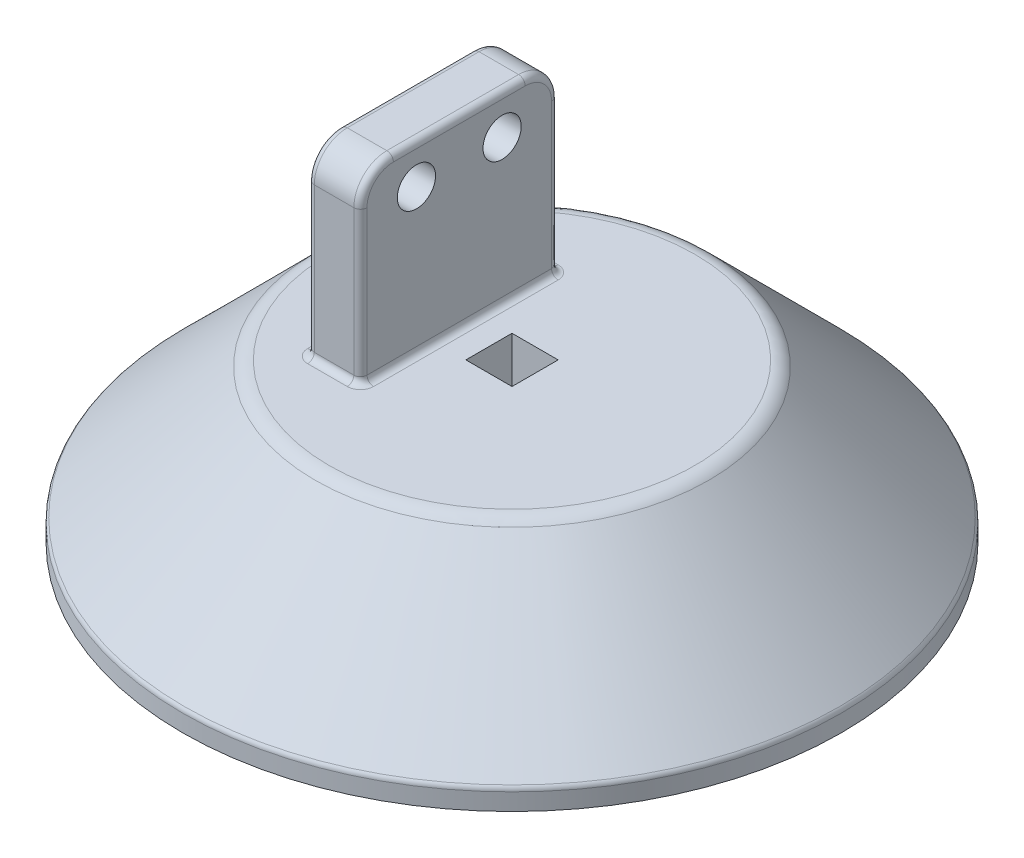
ISO-10303-21;
HEADER;
FILE_DESCRIPTION(('STEP AP214'),'2;1');
FILE_NAME('part.step','',(''),(''),'','','');
FILE_SCHEMA(('AUTOMOTIVE_DESIGN { 1 0 10303 214 1 1 1 1 }'));
ENDSEC;
DATA;
#1=APPLICATION_CONTEXT('core data for automotive mechanical design processes');
#2=APPLICATION_PROTOCOL_DEFINITION('international standard','automotive_design',2000,#1);
#3=PRODUCT_CONTEXT('',#1,'mechanical');
#4=PRODUCT('Part','Part','',(#3));
#5=PRODUCT_RELATED_PRODUCT_CATEGORY('part','',(#4));
#6=PRODUCT_DEFINITION_FORMATION('','',#4);
#7=PRODUCT_DEFINITION_CONTEXT('part definition',#1,'design');
#8=PRODUCT_DEFINITION('design','',#6,#7);
#9=PRODUCT_DEFINITION_SHAPE('','',#8);
#10=(LENGTH_UNIT() NAMED_UNIT(*) SI_UNIT(.MILLI.,.METRE.));
#11=(NAMED_UNIT(*) PLANE_ANGLE_UNIT() SI_UNIT($,.RADIAN.));
#12=(NAMED_UNIT(*) SI_UNIT($,.STERADIAN.) SOLID_ANGLE_UNIT());
#13=UNCERTAINTY_MEASURE_WITH_UNIT(LENGTH_MEASURE(1.E-05),#10,'distance_accuracy_value','');
#14=(GEOMETRIC_REPRESENTATION_CONTEXT(3) GLOBAL_UNCERTAINTY_ASSIGNED_CONTEXT((#13)) GLOBAL_UNIT_ASSIGNED_CONTEXT((#10,
#11,#12)) REPRESENTATION_CONTEXT('',''));
#15=CARTESIAN_POINT('',(0.,0.,0.));
#16=DIRECTION('',(0.,0.,1.));
#17=DIRECTION('',(1.,0.,0.));
#18=AXIS2_PLACEMENT_3D('',#15,#16,#17);
#19=CARTESIAN_POINT('',(0.,24.,0.));
#20=DIRECTION('',(0.,-1.,0.));
#21=DIRECTION('',(0.,0.,-1.));
#22=AXIS2_PLACEMENT_3D('',#19,#20,#21);
#23=PLANE('',#22);
#24=DIRECTION('',(1.,0.,0.));
#25=VECTOR('',#24,1.);
#26=CARTESIAN_POINT('',(-3.5,24.,3.5));
#27=LINE('',#26,#25);
#28=CARTESIAN_POINT('',(-3.5,24.,3.5));
#29=VERTEX_POINT('',#28);
#30=CARTESIAN_POINT('',(3.5,24.,3.5));
#31=VERTEX_POINT('',#30);
#32=EDGE_CURVE('E201',#29,#31,#27,.T.);
#33=ORIENTED_EDGE('',*,*,#32,.F.);
#34=DIRECTION('',(0.,0.,1.));
#35=VECTOR('',#34,1.);
#36=CARTESIAN_POINT('',(-3.5,24.,-3.5));
#37=LINE('',#36,#35);
#38=CARTESIAN_POINT('',(-3.5,24.,-3.5));
#39=VERTEX_POINT('',#38);
#40=EDGE_CURVE('E52',#39,#29,#37,.T.);
#41=ORIENTED_EDGE('',*,*,#40,.F.);
#42=DIRECTION('',(-1.,0.,0.));
#43=VECTOR('',#42,1.);
#44=CARTESIAN_POINT('',(-3.5,24.,-3.5));
#45=LINE('',#44,#43);
#46=CARTESIAN_POINT('',(3.5,24.,-3.5));
#47=VERTEX_POINT('',#46);
#48=EDGE_CURVE('E192',#47,#39,#45,.T.);
#49=ORIENTED_EDGE('',*,*,#48,.F.);
#50=DIRECTION('',(0.,0.,-1.));
#51=VECTOR('',#50,1.);
#52=CARTESIAN_POINT('',(3.5,24.,-3.5));
#53=LINE('',#52,#51);
#54=EDGE_CURVE('E195',#31,#47,#53,.T.);
#55=ORIENTED_EDGE('',*,*,#54,.F.);
#56=EDGE_LOOP('',(#33,#41,#49,#55));
#57=FACE_BOUND('',#56,.T.);
#58=CARTESIAN_POINT('',(-9.00000000000001,24.,-14.));
#59=DIRECTION('',(0.,-1.,0.));
#60=DIRECTION('',(0.,0.,-1.));
#61=AXIS2_PLACEMENT_3D('',#58,#59,#60);
#62=CIRCLE('',#61,2.);
#63=CARTESIAN_POINT('',(-7.,24.,-14.));
#64=VERTEX_POINT('',#63);
#65=CARTESIAN_POINT('',(-9.00000000000001,24.,-16.));
#66=VERTEX_POINT('',#65);
#67=EDGE_CURVE('E313',#64,#66,#62,.F.);
#68=ORIENTED_EDGE('',*,*,#67,.F.);
#69=DIRECTION('',(0.,0.,-1.));
#70=VECTOR('',#69,1.);
#71=CARTESIAN_POINT('',(-7.,24.,15.));
#72=LINE('',#71,#70);
#73=CARTESIAN_POINT('',(-7.,24.,14.));
#74=VERTEX_POINT('',#73);
#75=EDGE_CURVE('E11',#64,#74,#72,.F.);
#76=ORIENTED_EDGE('',*,*,#75,.T.);
#77=CARTESIAN_POINT('',(-9.00000000000001,24.,14.));
#78=DIRECTION('',(0.,-1.,0.));
#79=DIRECTION('',(0.,0.,-1.));
#80=AXIS2_PLACEMENT_3D('',#77,#78,#79);
#81=CIRCLE('',#80,2.);
#82=CARTESIAN_POINT('',(-9.00000000000001,24.,16.));
#83=VERTEX_POINT('',#82);
#84=EDGE_CURVE('E44',#83,#74,#81,.F.);
#85=ORIENTED_EDGE('',*,*,#84,.F.);
#86=DIRECTION('',(1.,0.,0.));
#87=VECTOR('',#86,1.);
#88=CARTESIAN_POINT('',(-16.,24.,16.));
#89=LINE('',#88,#87);
#90=CARTESIAN_POINT('',(-15.,24.,16.));
#91=VERTEX_POINT('',#90);
#92=EDGE_CURVE('E310',#83,#91,#89,.F.);
#93=ORIENTED_EDGE('',*,*,#92,.T.);
#94=CARTESIAN_POINT('',(-15.,24.,14.));
#95=DIRECTION('',(0.,-1.,0.));
#96=DIRECTION('',(0.,0.,-1.));
#97=AXIS2_PLACEMENT_3D('',#94,#95,#96);
#98=CIRCLE('',#97,2.);
#99=CARTESIAN_POINT('',(-17.,24.,14.));
#100=VERTEX_POINT('',#99);
#101=EDGE_CURVE('E308',#100,#91,#98,.F.);
#102=ORIENTED_EDGE('',*,*,#101,.F.);
#103=DIRECTION('',(0.,0.,1.));
#104=VECTOR('',#103,1.);
#105=CARTESIAN_POINT('',(-17.,24.,-15.));
#106=LINE('',#105,#104);
#107=CARTESIAN_POINT('',(-17.,24.,-14.));
#108=VERTEX_POINT('',#107);
#109=EDGE_CURVE('E304',#100,#108,#106,.F.);
#110=ORIENTED_EDGE('',*,*,#109,.T.);
#111=CARTESIAN_POINT('',(-15.,24.,-14.));
#112=DIRECTION('',(0.,-1.,0.));
#113=DIRECTION('',(0.,0.,-1.));
#114=AXIS2_PLACEMENT_3D('',#111,#112,#113);
#115=CIRCLE('',#114,2.);
#116=CARTESIAN_POINT('',(-15.,24.,-16.));
#117=VERTEX_POINT('',#116);
#118=EDGE_CURVE('E301',#117,#108,#115,.F.);
#119=ORIENTED_EDGE('',*,*,#118,.F.);
#120=DIRECTION('',(-1.,0.,0.));
#121=VECTOR('',#120,1.);
#122=CARTESIAN_POINT('',(-8.,24.,-16.));
#123=LINE('',#122,#121);
#124=EDGE_CURVE('E306',#117,#66,#123,.F.);
#125=ORIENTED_EDGE('',*,*,#124,.T.);
#126=EDGE_LOOP('',(#68,#76,#85,#93,#102,#110,#119,#125));
#127=FACE_BOUND('',#126,.T.);
#128=CARTESIAN_POINT('',(0.,24.,0.));
#129=DIRECTION('',(0.,-1.,0.));
#130=DIRECTION('',(0.,0.,-1.));
#131=AXIS2_PLACEMENT_3D('',#128,#129,#130);
#132=CIRCLE('',#131,27.7573593128807);
#133=CARTESIAN_POINT('',(0.,24.,-27.7573593128807));
#134=VERTEX_POINT('',#133);
#135=EDGE_CURVE('E241',#134,#134,#132,.F.);
#136=ORIENTED_EDGE('',*,*,#135,.T.);
#137=EDGE_LOOP('',(#136));
#138=FACE_BOUND('',#137,.T.);
#139=ADVANCED_FACE('F35',(#57,#127,#138),#23,.F.);
#140=CARTESIAN_POINT('',(-50.,0.,0.));
#141=DIRECTION('',(0.,1.,0.));
#142=DIRECTION('',(0.,0.,1.));
#143=AXIS2_PLACEMENT_3D('',#140,#141,#142);
#144=PLANE('',#143);
#145=CARTESIAN_POINT('',(0.,0.,0.));
#146=DIRECTION('',(0.,-1.,0.));
#147=DIRECTION('',(0.,0.,-1.));
#148=AXIS2_PLACEMENT_3D('',#145,#146,#147);
#149=CIRCLE('',#148,50.);
#150=CARTESIAN_POINT('',(0.,0.,-50.));
#151=VERTEX_POINT('',#150);
#152=EDGE_CURVE('E223',#151,#151,#149,.T.);
#153=ORIENTED_EDGE('',*,*,#152,.T.);
#154=EDGE_LOOP('',(#153));
#155=FACE_BOUND('',#154,.T.);
#156=ADVANCED_FACE('F481',(#155),#144,.F.);
#157=CARTESIAN_POINT('',(0.,24.,0.));
#158=DIRECTION('',(0.,-1.,0.));
#159=DIRECTION('',(0.,0.,-1.));
#160=AXIS2_PLACEMENT_3D('',#157,#158,#159);
#161=CONICAL_SURFACE('',#160,29.,0.785398163397448);
#162=CARTESIAN_POINT('',(0.,3.29289321881347,0.));
#163=DIRECTION('',(0.,1.,0.));
#164=DIRECTION('',(0.,0.,1.));
#165=AXIS2_PLACEMENT_3D('',#162,#163,#164);
#166=CIRCLE('',#165,49.7071067811865);
#167=CARTESIAN_POINT('',(0.,3.29289321881347,49.7071067811865));
#168=VERTEX_POINT('',#167);
#169=EDGE_CURVE('E247',#168,#168,#166,.T.);
#170=ORIENTED_EDGE('',*,*,#169,.T.);
#171=EDGE_LOOP('',(#170));
#172=FACE_BOUND('',#171,.T.);
#173=CARTESIAN_POINT('',(0.,23.1213203435596,0.));
#174=DIRECTION('',(0.,1.,0.));
#175=DIRECTION('',(0.,0.,1.));
#176=AXIS2_PLACEMENT_3D('',#173,#174,#175);
#177=CIRCLE('',#176,29.8786796564404);
#178=CARTESIAN_POINT('',(0.,23.1213203435596,29.8786796564404));
#179=VERTEX_POINT('',#178);
#180=EDGE_CURVE('E238',#179,#179,#177,.F.);
#181=ORIENTED_EDGE('',*,*,#180,.T.);
#182=EDGE_LOOP('',(#181));
#183=FACE_BOUND('',#182,.T.);
#184=ADVANCED_FACE('F487',(#172,#183),#161,.T.);
#185=CARTESIAN_POINT('',(0.,0.,0.));
#186=DIRECTION('',(0.,-1.,0.));
#187=DIRECTION('',(0.,0.,-1.));
#188=AXIS2_PLACEMENT_3D('',#185,#186,#187);
#189=CYLINDRICAL_SURFACE('',#188,50.);
#190=CARTESIAN_POINT('',(0.,2.58578643762692,0.));
#191=DIRECTION('',(0.,1.,0.));
#192=DIRECTION('',(0.,0.,1.));
#193=AXIS2_PLACEMENT_3D('',#190,#191,#192);
#194=CIRCLE('',#193,50.);
#195=CARTESIAN_POINT('',(0.,2.58578643762692,50.));
#196=VERTEX_POINT('',#195);
#197=EDGE_CURVE('E244',#196,#196,#194,.F.);
#198=ORIENTED_EDGE('',*,*,#197,.T.);
#199=EDGE_LOOP('',(#198));
#200=FACE_BOUND('',#199,.T.);
#201=ORIENTED_EDGE('',*,*,#152,.F.);
#202=EDGE_LOOP('',(#201));
#203=FACE_BOUND('',#202,.T.);
#204=ADVANCED_FACE('F750',(#200,#203),#189,.T.);
#205=CARTESIAN_POINT('',(-16.,52.,-15.));
#206=DIRECTION('',(1.,0.,0.));
#207=DIRECTION('',(0.,0.,-1.));
#208=AXIS2_PLACEMENT_3D('',#205,#206,#207);
#209=PLANE('',#208);
#210=CARTESIAN_POINT('',(-16.,47.,10.));
#211=DIRECTION('',(1.,0.,0.));
#212=DIRECTION('',(0.,0.,-1.));
#213=AXIS2_PLACEMENT_3D('',#210,#211,#212);
#214=CIRCLE('',#213,4.);
#215=CARTESIAN_POINT('',(-16.,47.,14.));
#216=VERTEX_POINT('',#215);
#217=CARTESIAN_POINT('',(-16.,51.,10.));
#218=VERTEX_POINT('',#217);
#219=EDGE_CURVE('E257',#216,#218,#214,.F.);
#220=ORIENTED_EDGE('',*,*,#219,.T.);
#221=DIRECTION('',(0.,0.,1.));
#222=VECTOR('',#221,1.);
#223=CARTESIAN_POINT('',(-16.,51.,-10.));
#224=LINE('',#223,#222);
#225=CARTESIAN_POINT('',(-16.,51.,-10.));
#226=VERTEX_POINT('',#225);
#227=EDGE_CURVE('E261',#218,#226,#224,.F.);
#228=ORIENTED_EDGE('',*,*,#227,.T.);
#229=CARTESIAN_POINT('',(-16.,47.,-10.));
#230=DIRECTION('',(1.,0.,0.));
#231=DIRECTION('',(0.,0.,-1.));
#232=AXIS2_PLACEMENT_3D('',#229,#230,#231);
#233=CIRCLE('',#232,4.);
#234=CARTESIAN_POINT('',(-16.,47.,-14.));
#235=VERTEX_POINT('',#234);
#236=EDGE_CURVE('E259',#226,#235,#233,.F.);
#237=ORIENTED_EDGE('',*,*,#236,.T.);
#238=DIRECTION('',(0.,-1.,0.));
#239=VECTOR('',#238,1.);
#240=CARTESIAN_POINT('',(-16.,52.,-14.));
#241=LINE('',#240,#239);
#242=CARTESIAN_POINT('',(-16.,25.,-14.));
#243=VERTEX_POINT('',#242);
#244=EDGE_CURVE('E254',#235,#243,#241,.T.);
#245=ORIENTED_EDGE('',*,*,#244,.T.);
#246=DIRECTION('',(0.,0.,1.));
#247=VECTOR('',#246,1.);
#248=CARTESIAN_POINT('',(-16.,25.,15.));
#249=LINE('',#248,#247);
#250=CARTESIAN_POINT('',(-16.,25.,14.));
#251=VERTEX_POINT('',#250);
#252=EDGE_CURVE('E250',#243,#251,#249,.T.);
#253=ORIENTED_EDGE('',*,*,#252,.T.);
#254=DIRECTION('',(0.,-1.,0.));
#255=VECTOR('',#254,1.);
#256=CARTESIAN_POINT('',(-16.,52.,14.));
#257=LINE('',#256,#255);
#258=EDGE_CURVE('E252',#251,#216,#257,.F.);
#259=ORIENTED_EDGE('',*,*,#258,.T.);
#260=EDGE_LOOP('',(#220,#228,#237,#245,#253,#259));
#261=FACE_BOUND('',#260,.T.);
#262=CARTESIAN_POINT('',(-16.,46.,-6.5));
#263=DIRECTION('',(1.,0.,0.));
#264=DIRECTION('',(0.,0.,-1.));
#265=AXIS2_PLACEMENT_3D('',#262,#263,#264);
#266=CIRCLE('',#265,2.9);
#267=CARTESIAN_POINT('',(-16.,46.,-9.4));
#268=VERTEX_POINT('',#267);
#269=EDGE_CURVE('E214',#268,#268,#266,.F.);
#270=ORIENTED_EDGE('',*,*,#269,.F.);
#271=EDGE_LOOP('',(#270));
#272=FACE_BOUND('',#271,.T.);
#273=CARTESIAN_POINT('',(-16.,46.,6.5));
#274=DIRECTION('',(1.,0.,0.));
#275=DIRECTION('',(0.,0.,-1.));
#276=AXIS2_PLACEMENT_3D('',#273,#274,#275);
#277=CIRCLE('',#276,2.9);
#278=CARTESIAN_POINT('',(-16.,46.,3.6));
#279=VERTEX_POINT('',#278);
#280=EDGE_CURVE('E220',#279,#279,#277,.F.);
#281=ORIENTED_EDGE('',*,*,#280,.F.);
#282=EDGE_LOOP('',(#281));
#283=FACE_BOUND('',#282,.T.);
#284=ADVANCED_FACE('F404',(#261,#272,#283),#209,.F.);
#285=CARTESIAN_POINT('',(-16.,52.,15.));
#286=DIRECTION('',(0.,0.,-1.));
#287=DIRECTION('',(-1.,0.,0.));
#288=AXIS2_PLACEMENT_3D('',#285,#286,#287);
#289=PLANE('',#288);
#290=DIRECTION('',(1.,0.,0.));
#291=VECTOR('',#290,1.);
#292=CARTESIAN_POINT('',(-16.,47.,15.));
#293=LINE('',#292,#291);
#294=CARTESIAN_POINT('',(-9.00000000000001,47.,15.));
#295=VERTEX_POINT('',#294);
#296=CARTESIAN_POINT('',(-15.,47.,15.));
#297=VERTEX_POINT('',#296);
#298=EDGE_CURVE('E235',#295,#297,#293,.F.);
#299=ORIENTED_EDGE('',*,*,#298,.T.);
#300=DIRECTION('',(0.,-1.,0.));
#301=VECTOR('',#300,1.);
#302=CARTESIAN_POINT('',(-15.,52.,15.));
#303=LINE('',#302,#301);
#304=CARTESIAN_POINT('',(-15.,25.,15.));
#305=VERTEX_POINT('',#304);
#306=EDGE_CURVE('E278',#297,#305,#303,.T.);
#307=ORIENTED_EDGE('',*,*,#306,.T.);
#308=DIRECTION('',(1.,0.,0.));
#309=VECTOR('',#308,1.);
#310=CARTESIAN_POINT('',(-8.,25.,15.));
#311=LINE('',#310,#309);
#312=CARTESIAN_POINT('',(-9.00000000000001,25.,15.));
#313=VERTEX_POINT('',#312);
#314=EDGE_CURVE('E274',#305,#313,#311,.T.);
#315=ORIENTED_EDGE('',*,*,#314,.T.);
#316=DIRECTION('',(0.,-1.,0.));
#317=VECTOR('',#316,1.);
#318=CARTESIAN_POINT('',(-9.00000000000001,52.,15.));
#319=LINE('',#318,#317);
#320=EDGE_CURVE('E276',#313,#295,#319,.F.);
#321=ORIENTED_EDGE('',*,*,#320,.T.);
#322=EDGE_LOOP('',(#299,#307,#315,#321));
#323=FACE_BOUND('',#322,.T.);
#324=ADVANCED_FACE('F413',(#323),#289,.F.);
#325=CARTESIAN_POINT('',(-8.,52.,-15.));
#326=DIRECTION('',(-1.,0.,0.));
#327=DIRECTION('',(0.,0.,1.));
#328=AXIS2_PLACEMENT_3D('',#325,#326,#327);
#329=PLANE('',#328);
#330=CARTESIAN_POINT('',(-8.,47.,-10.));
#331=DIRECTION('',(-1.,0.,0.));
#332=DIRECTION('',(0.,0.,1.));
#333=AXIS2_PLACEMENT_3D('',#330,#331,#332);
#334=CIRCLE('',#333,4.);
#335=CARTESIAN_POINT('',(-8.,47.,-14.));
#336=VERTEX_POINT('',#335);
#337=CARTESIAN_POINT('',(-8.,51.,-10.));
#338=VERTEX_POINT('',#337);
#339=EDGE_CURVE('E291',#336,#338,#334,.F.);
#340=ORIENTED_EDGE('',*,*,#339,.T.);
#341=DIRECTION('',(0.,0.,-1.));
#342=VECTOR('',#341,1.);
#343=CARTESIAN_POINT('',(-8.,51.,10.));
#344=LINE('',#343,#342);
#345=CARTESIAN_POINT('',(-8.,51.,10.));
#346=VERTEX_POINT('',#345);
#347=EDGE_CURVE('E295',#338,#346,#344,.F.);
#348=ORIENTED_EDGE('',*,*,#347,.T.);
#349=CARTESIAN_POINT('',(-8.,47.,10.));
#350=DIRECTION('',(-1.,0.,0.));
#351=DIRECTION('',(0.,0.,1.));
#352=AXIS2_PLACEMENT_3D('',#349,#350,#351);
#353=CIRCLE('',#352,4.);
#354=CARTESIAN_POINT('',(-8.,47.,14.));
#355=VERTEX_POINT('',#354);
#356=EDGE_CURVE('E293',#346,#355,#353,.F.);
#357=ORIENTED_EDGE('',*,*,#356,.T.);
#358=DIRECTION('',(0.,-1.,0.));
#359=VECTOR('',#358,1.);
#360=CARTESIAN_POINT('',(-8.,52.,14.));
#361=LINE('',#360,#359);
#362=CARTESIAN_POINT('',(-8.,25.,14.));
#363=VERTEX_POINT('',#362);
#364=EDGE_CURVE('E288',#355,#363,#361,.T.);
#365=ORIENTED_EDGE('',*,*,#364,.T.);
#366=DIRECTION('',(0.,0.,-1.));
#367=VECTOR('',#366,1.);
#368=CARTESIAN_POINT('',(-8.,25.,-15.));
#369=LINE('',#368,#367);
#370=CARTESIAN_POINT('',(-8.,25.,-14.));
#371=VERTEX_POINT('',#370);
#372=EDGE_CURVE('E284',#363,#371,#369,.T.);
#373=ORIENTED_EDGE('',*,*,#372,.T.);
#374=DIRECTION('',(0.,-1.,0.));
#375=VECTOR('',#374,1.);
#376=CARTESIAN_POINT('',(-8.,52.,-14.));
#377=LINE('',#376,#375);
#378=EDGE_CURVE('E286',#371,#336,#377,.F.);
#379=ORIENTED_EDGE('',*,*,#378,.T.);
#380=EDGE_LOOP('',(#340,#348,#357,#365,#373,#379));
#381=FACE_BOUND('',#380,.T.);
#382=CARTESIAN_POINT('',(-8.00000000000001,46.,-6.5));
#383=DIRECTION('',(-1.,0.,0.));
#384=DIRECTION('',(0.,0.,1.));
#385=AXIS2_PLACEMENT_3D('',#382,#383,#384);
#386=CIRCLE('',#385,2.9);
#387=CARTESIAN_POINT('',(-8.00000000000001,46.,-3.6));
#388=VERTEX_POINT('',#387);
#389=EDGE_CURVE('E211',#388,#388,#386,.F.);
#390=ORIENTED_EDGE('',*,*,#389,.F.);
#391=EDGE_LOOP('',(#390));
#392=FACE_BOUND('',#391,.T.);
#393=CARTESIAN_POINT('',(-8.00000000000001,46.,6.5));
#394=DIRECTION('',(-1.,0.,0.));
#395=DIRECTION('',(0.,0.,1.));
#396=AXIS2_PLACEMENT_3D('',#393,#394,#395);
#397=CIRCLE('',#396,2.9);
#398=CARTESIAN_POINT('',(-8.00000000000001,46.,9.4));
#399=VERTEX_POINT('',#398);
#400=EDGE_CURVE('E217',#399,#399,#397,.F.);
#401=ORIENTED_EDGE('',*,*,#400,.F.);
#402=EDGE_LOOP('',(#401));
#403=FACE_BOUND('',#402,.T.);
#404=ADVANCED_FACE('F431',(#381,#392,#403),#329,.F.);
#405=CARTESIAN_POINT('',(-16.,52.,-15.));
#406=DIRECTION('',(0.,0.,1.));
#407=DIRECTION('',(1.,0.,0.));
#408=AXIS2_PLACEMENT_3D('',#405,#406,#407);
#409=PLANE('',#408);
#410=DIRECTION('',(-1.,0.,0.));
#411=VECTOR('',#410,1.);
#412=CARTESIAN_POINT('',(-16.,25.,-15.));
#413=LINE('',#412,#411);
#414=CARTESIAN_POINT('',(-9.00000000000001,25.,-15.));
#415=VERTEX_POINT('',#414);
#416=CARTESIAN_POINT('',(-15.,25.,-15.));
#417=VERTEX_POINT('',#416);
#418=EDGE_CURVE('E263',#415,#417,#413,.T.);
#419=ORIENTED_EDGE('',*,*,#418,.T.);
#420=DIRECTION('',(0.,-1.,0.));
#421=VECTOR('',#420,1.);
#422=CARTESIAN_POINT('',(-15.,52.,-15.));
#423=LINE('',#422,#421);
#424=CARTESIAN_POINT('',(-15.,47.,-15.));
#425=VERTEX_POINT('',#424);
#426=EDGE_CURVE('E267',#417,#425,#423,.F.);
#427=ORIENTED_EDGE('',*,*,#426,.T.);
#428=DIRECTION('',(-1.,0.,0.));
#429=VECTOR('',#428,1.);
#430=CARTESIAN_POINT('',(-8.,47.,-15.));
#431=LINE('',#430,#429);
#432=CARTESIAN_POINT('',(-9.00000000000001,47.,-15.));
#433=VERTEX_POINT('',#432);
#434=EDGE_CURVE('E232',#425,#433,#431,.F.);
#435=ORIENTED_EDGE('',*,*,#434,.T.);
#436=DIRECTION('',(0.,-1.,0.));
#437=VECTOR('',#436,1.);
#438=CARTESIAN_POINT('',(-9.00000000000001,52.,-15.));
#439=LINE('',#438,#437);
#440=EDGE_CURVE('E265',#433,#415,#439,.T.);
#441=ORIENTED_EDGE('',*,*,#440,.T.);
#442=EDGE_LOOP('',(#419,#427,#435,#441));
#443=FACE_BOUND('',#442,.T.);
#444=ADVANCED_FACE('F446',(#443),#409,.F.);
#445=CARTESIAN_POINT('',(0.,52.,0.));
#446=DIRECTION('',(0.,1.,0.));
#447=DIRECTION('',(0.,0.,1.));
#448=AXIS2_PLACEMENT_3D('',#445,#446,#447);
#449=PLANE('',#448);
#450=DIRECTION('',(-1.,0.,0.));
#451=VECTOR('',#450,1.);
#452=CARTESIAN_POINT('',(-16.,52.,-10.));
#453=LINE('',#452,#451);
#454=CARTESIAN_POINT('',(-9.00000000000001,52.,-10.));
#455=VERTEX_POINT('',#454);
#456=CARTESIAN_POINT('',(-15.,52.,-10.));
#457=VERTEX_POINT('',#456);
#458=EDGE_CURVE('E229',#455,#457,#453,.T.);
#459=ORIENTED_EDGE('',*,*,#458,.T.);
#460=DIRECTION('',(0.,0.,1.));
#461=VECTOR('',#460,1.);
#462=CARTESIAN_POINT('',(-15.,52.,10.));
#463=LINE('',#462,#461);
#464=CARTESIAN_POINT('',(-15.,52.,10.));
#465=VERTEX_POINT('',#464);
#466=EDGE_CURVE('E299',#457,#465,#463,.T.);
#467=ORIENTED_EDGE('',*,*,#466,.T.);
#468=DIRECTION('',(1.,0.,0.));
#469=VECTOR('',#468,1.);
#470=CARTESIAN_POINT('',(-8.,52.,10.));
#471=LINE('',#470,#469);
#472=CARTESIAN_POINT('',(-9.00000000000001,52.,10.));
#473=VERTEX_POINT('',#472);
#474=EDGE_CURVE('E226',#465,#473,#471,.T.);
#475=ORIENTED_EDGE('',*,*,#474,.T.);
#476=DIRECTION('',(0.,0.,-1.));
#477=VECTOR('',#476,1.);
#478=CARTESIAN_POINT('',(-9.00000000000001,52.,-10.));
#479=LINE('',#478,#477);
#480=EDGE_CURVE('E297',#473,#455,#479,.T.);
#481=ORIENTED_EDGE('',*,*,#480,.T.);
#482=EDGE_LOOP('',(#459,#467,#475,#481));
#483=FACE_BOUND('',#482,.T.);
#484=ADVANCED_FACE('F389',(#483),#449,.T.);
#485=CARTESIAN_POINT('',(-50.001,46.,6.5));
#486=DIRECTION('',(1.,0.,0.));
#487=DIRECTION('',(0.,0.,-1.));
#488=AXIS2_PLACEMENT_3D('',#485,#486,#487);
#489=CYLINDRICAL_SURFACE('',#488,2.9);
#490=ORIENTED_EDGE('',*,*,#400,.T.);
#491=EDGE_LOOP('',(#490));
#492=FACE_BOUND('',#491,.T.);
#493=ORIENTED_EDGE('',*,*,#280,.T.);
#494=EDGE_LOOP('',(#493));
#495=FACE_BOUND('',#494,.T.);
#496=ADVANCED_FACE('F706',(#492,#495),#489,.F.);
#497=CARTESIAN_POINT('',(-50.001,46.,-6.5));
#498=DIRECTION('',(1.,0.,0.));
#499=DIRECTION('',(0.,0.,-1.));
#500=AXIS2_PLACEMENT_3D('',#497,#498,#499);
#501=CYLINDRICAL_SURFACE('',#500,2.9);
#502=ORIENTED_EDGE('',*,*,#389,.T.);
#503=EDGE_LOOP('',(#502));
#504=FACE_BOUND('',#503,.T.);
#505=ORIENTED_EDGE('',*,*,#269,.T.);
#506=EDGE_LOOP('',(#505));
#507=FACE_BOUND('',#506,.T.);
#508=ADVANCED_FACE('F495',(#504,#507),#501,.F.);
#509=CARTESIAN_POINT('',(0.,47.,-10.));
#510=DIRECTION('',(1.,0.,0.));
#511=DIRECTION('',(0.,0.,-1.));
#512=AXIS2_PLACEMENT_3D('',#509,#510,#511);
#513=CYLINDRICAL_SURFACE('',#512,5.);
#514=ORIENTED_EDGE('',*,*,#434,.F.);
#515=CARTESIAN_POINT('',(-15.,47.,-10.));
#516=DIRECTION('',(1.,0.,0.));
#517=DIRECTION('',(0.,0.,-1.));
#518=AXIS2_PLACEMENT_3D('',#515,#516,#517);
#519=CIRCLE('',#518,5.);
#520=EDGE_CURVE('E272',#425,#457,#519,.T.);
#521=ORIENTED_EDGE('',*,*,#520,.T.);
#522=ORIENTED_EDGE('',*,*,#458,.F.);
#523=CARTESIAN_POINT('',(-9.00000000000001,47.,-10.));
#524=DIRECTION('',(-1.,0.,0.));
#525=DIRECTION('',(0.,0.,1.));
#526=AXIS2_PLACEMENT_3D('',#523,#524,#525);
#527=CIRCLE('',#526,5.);
#528=EDGE_CURVE('E270',#455,#433,#527,.T.);
#529=ORIENTED_EDGE('',*,*,#528,.T.);
#530=EDGE_LOOP('',(#514,#521,#522,#529));
#531=FACE_BOUND('',#530,.T.);
#532=ADVANCED_FACE('F444',(#531),#513,.T.);
#533=CARTESIAN_POINT('',(0.,47.,10.));
#534=DIRECTION('',(-1.,0.,0.));
#535=DIRECTION('',(0.,0.,1.));
#536=AXIS2_PLACEMENT_3D('',#533,#534,#535);
#537=CYLINDRICAL_SURFACE('',#536,5.);
#538=ORIENTED_EDGE('',*,*,#474,.F.);
#539=CARTESIAN_POINT('',(-15.,47.,10.));
#540=DIRECTION('',(1.,0.,0.));
#541=DIRECTION('',(0.,0.,-1.));
#542=AXIS2_PLACEMENT_3D('',#539,#540,#541);
#543=CIRCLE('',#542,5.);
#544=EDGE_CURVE('E282',#465,#297,#543,.T.);
#545=ORIENTED_EDGE('',*,*,#544,.T.);
#546=ORIENTED_EDGE('',*,*,#298,.F.);
#547=CARTESIAN_POINT('',(-9.00000000000001,47.,10.));
#548=DIRECTION('',(-1.,0.,0.));
#549=DIRECTION('',(0.,0.,1.));
#550=AXIS2_PLACEMENT_3D('',#547,#548,#549);
#551=CIRCLE('',#550,5.);
#552=EDGE_CURVE('E280',#295,#473,#551,.T.);
#553=ORIENTED_EDGE('',*,*,#552,.T.);
#554=EDGE_LOOP('',(#538,#545,#546,#553));
#555=FACE_BOUND('',#554,.T.);
#556=ADVANCED_FACE('F386',(#555),#537,.T.);
#557=CARTESIAN_POINT('',(0.,21.,0.));
#558=DIRECTION('',(0.,-1.,0.));
#559=DIRECTION('',(0.,0.,-1.));
#560=AXIS2_PLACEMENT_3D('',#557,#558,#559);
#561=TOROIDAL_SURFACE('',#560,27.7573593128807,3.);
#562=ORIENTED_EDGE('',*,*,#135,.F.);
#563=EDGE_LOOP('',(#562));
#564=FACE_BOUND('',#563,.T.);
#565=ORIENTED_EDGE('',*,*,#180,.F.);
#566=EDGE_LOOP('',(#565));
#567=FACE_BOUND('',#566,.T.);
#568=ADVANCED_FACE('F498',(#564,#567),#561,.T.);
#569=CARTESIAN_POINT('',(0.,2.58578643762692,0.));
#570=DIRECTION('',(0.,1.,0.));
#571=DIRECTION('',(0.,0.,1.));
#572=AXIS2_PLACEMENT_3D('',#569,#570,#571);
#573=TOROIDAL_SURFACE('',#572,49.,1.);
#574=ORIENTED_EDGE('',*,*,#169,.F.);
#575=EDGE_LOOP('',(#574));
#576=FACE_BOUND('',#575,.T.);
#577=ORIENTED_EDGE('',*,*,#197,.F.);
#578=EDGE_LOOP('',(#577));
#579=FACE_BOUND('',#578,.T.);
#580=ADVANCED_FACE('F501',(#576,#579),#573,.T.);
#581=CARTESIAN_POINT('',(-9.00000000000001,47.,10.));
#582=DIRECTION('',(-1.,0.,0.));
#583=DIRECTION('',(0.,0.,1.));
#584=AXIS2_PLACEMENT_3D('',#581,#582,#583);
#585=TOROIDAL_SURFACE('',#584,4.,1.);
#586=CARTESIAN_POINT('',(-9.00000000000001,51.,10.));
#587=DIRECTION('',(0.,0.,-1.));
#588=DIRECTION('',(-1.,0.,0.));
#589=AXIS2_PLACEMENT_3D('',#586,#587,#588);
#590=CIRCLE('',#589,1.);
#591=EDGE_CURVE('E367',#473,#346,#590,.T.);
#592=ORIENTED_EDGE('',*,*,#591,.F.);
#593=ORIENTED_EDGE('',*,*,#552,.F.);
#594=CARTESIAN_POINT('',(-9.00000000000001,47.,14.));
#595=DIRECTION('',(0.,-1.,0.));
#596=DIRECTION('',(0.,0.,-1.));
#597=AXIS2_PLACEMENT_3D('',#594,#595,#596);
#598=CIRCLE('',#597,1.);
#599=EDGE_CURVE('E39',#355,#295,#598,.T.);
#600=ORIENTED_EDGE('',*,*,#599,.F.);
#601=ORIENTED_EDGE('',*,*,#356,.F.);
#602=EDGE_LOOP('',(#592,#593,#600,#601));
#603=FACE_BOUND('',#602,.T.);
#604=ADVANCED_FACE('F37',(#603),#585,.T.);
#605=CARTESIAN_POINT('',(-9.00000000000001,52.,14.));
#606=DIRECTION('',(0.,-1.,0.));
#607=DIRECTION('',(0.,0.,-1.));
#608=AXIS2_PLACEMENT_3D('',#605,#606,#607);
#609=CYLINDRICAL_SURFACE('',#608,1.);
#610=ORIENTED_EDGE('',*,*,#599,.T.);
#611=ORIENTED_EDGE('',*,*,#320,.F.);
#612=CARTESIAN_POINT('',(-9.00000000000001,25.,14.));
#613=DIRECTION('',(0.,-1.,0.));
#614=DIRECTION('',(0.,0.,-1.));
#615=AXIS2_PLACEMENT_3D('',#612,#613,#614);
#616=CIRCLE('',#615,1.);
#617=EDGE_CURVE('E365',#363,#313,#616,.T.);
#618=ORIENTED_EDGE('',*,*,#617,.F.);
#619=ORIENTED_EDGE('',*,*,#364,.F.);
#620=EDGE_LOOP('',(#610,#611,#618,#619));
#621=FACE_BOUND('',#620,.T.);
#622=ADVANCED_FACE('F378',(#621),#609,.T.);
#623=CARTESIAN_POINT('',(-9.00000000000001,51.,0.));
#624=DIRECTION('',(0.,0.,1.));
#625=DIRECTION('',(1.,0.,0.));
#626=AXIS2_PLACEMENT_3D('',#623,#624,#625);
#627=CYLINDRICAL_SURFACE('',#626,1.);
#628=ORIENTED_EDGE('',*,*,#591,.T.);
#629=ORIENTED_EDGE('',*,*,#347,.F.);
#630=CARTESIAN_POINT('',(-9.00000000000001,51.,-10.));
#631=DIRECTION('',(0.,0.,-1.));
#632=DIRECTION('',(-1.,0.,0.));
#633=AXIS2_PLACEMENT_3D('',#630,#631,#632);
#634=CIRCLE('',#633,1.);
#635=EDGE_CURVE('E362',#455,#338,#634,.T.);
#636=ORIENTED_EDGE('',*,*,#635,.F.);
#637=ORIENTED_EDGE('',*,*,#480,.F.);
#638=EDGE_LOOP('',(#628,#629,#636,#637));
#639=FACE_BOUND('',#638,.T.);
#640=ADVANCED_FACE('F436',(#639),#627,.T.);
#641=CARTESIAN_POINT('',(-9.00000000000001,25.,14.));
#642=DIRECTION('',(0.,-1.,0.));
#643=DIRECTION('',(0.,0.,-1.));
#644=AXIS2_PLACEMENT_3D('',#641,#642,#643);
#645=TOROIDAL_SURFACE('',#644,2.,1.);
#646=CARTESIAN_POINT('',(-7.,25.,14.));
#647=DIRECTION('',(0.,0.,-1.));
#648=DIRECTION('',(-1.,0.,0.));
#649=AXIS2_PLACEMENT_3D('',#646,#647,#648);
#650=CIRCLE('',#649,1.);
#651=EDGE_CURVE('E356',#363,#74,#650,.F.);
#652=ORIENTED_EDGE('',*,*,#651,.F.);
#653=ORIENTED_EDGE('',*,*,#617,.T.);
#654=CARTESIAN_POINT('',(-9.00000000000001,25.,16.));
#655=DIRECTION('',(-1.,0.,0.));
#656=DIRECTION('',(0.,0.,1.));
#657=AXIS2_PLACEMENT_3D('',#654,#655,#656);
#658=CIRCLE('',#657,1.);
#659=EDGE_CURVE('E359',#83,#313,#658,.F.);
#660=ORIENTED_EDGE('',*,*,#659,.F.);
#661=ORIENTED_EDGE('',*,*,#84,.T.);
#662=EDGE_LOOP('',(#652,#653,#660,#661));
#663=FACE_BOUND('',#662,.T.);
#664=ADVANCED_FACE('F429',(#663),#645,.F.);
#665=CARTESIAN_POINT('',(-9.00000000000001,47.,-10.));
#666=DIRECTION('',(-1.,0.,0.));
#667=DIRECTION('',(0.,0.,1.));
#668=AXIS2_PLACEMENT_3D('',#665,#666,#667);
#669=TOROIDAL_SURFACE('',#668,4.,1.);
#670=ORIENTED_EDGE('',*,*,#635,.T.);
#671=ORIENTED_EDGE('',*,*,#339,.F.);
#672=CARTESIAN_POINT('',(-9.00000000000001,47.,-14.));
#673=DIRECTION('',(0.,-1.,0.));
#674=DIRECTION('',(0.,0.,-1.));
#675=AXIS2_PLACEMENT_3D('',#672,#673,#674);
#676=CIRCLE('',#675,1.);
#677=EDGE_CURVE('E353',#433,#336,#676,.T.);
#678=ORIENTED_EDGE('',*,*,#677,.F.);
#679=ORIENTED_EDGE('',*,*,#528,.F.);
#680=EDGE_LOOP('',(#670,#671,#678,#679));
#681=FACE_BOUND('',#680,.T.);
#682=ADVANCED_FACE('F439',(#681),#669,.T.);
#683=CARTESIAN_POINT('',(-15.,52.,14.));
#684=DIRECTION('',(0.,-1.,0.));
#685=DIRECTION('',(0.,0.,-1.));
#686=AXIS2_PLACEMENT_3D('',#683,#684,#685);
#687=CYLINDRICAL_SURFACE('',#686,1.);
#688=CARTESIAN_POINT('',(-15.,25.,14.));
#689=DIRECTION('',(0.,-1.,0.));
#690=DIRECTION('',(0.,0.,-1.));
#691=AXIS2_PLACEMENT_3D('',#688,#689,#690);
#692=CIRCLE('',#691,1.);
#693=EDGE_CURVE('E347',#305,#251,#692,.T.);
#694=ORIENTED_EDGE('',*,*,#693,.F.);
#695=ORIENTED_EDGE('',*,*,#306,.F.);
#696=CARTESIAN_POINT('',(-15.,47.,14.));
#697=DIRECTION('',(0.,1.,0.));
#698=DIRECTION('',(0.,0.,1.));
#699=AXIS2_PLACEMENT_3D('',#696,#697,#698);
#700=CIRCLE('',#699,1.);
#701=EDGE_CURVE('E350',#216,#297,#700,.T.);
#702=ORIENTED_EDGE('',*,*,#701,.F.);
#703=ORIENTED_EDGE('',*,*,#258,.F.);
#704=EDGE_LOOP('',(#694,#695,#702,#703));
#705=FACE_BOUND('',#704,.T.);
#706=ADVANCED_FACE('F417',(#705),#687,.T.);
#707=CARTESIAN_POINT('',(-16.,25.,16.));
#708=DIRECTION('',(-1.,0.,0.));
#709=DIRECTION('',(0.,0.,1.));
#710=AXIS2_PLACEMENT_3D('',#707,#708,#709);
#711=CYLINDRICAL_SURFACE('',#710,1.);
#712=ORIENTED_EDGE('',*,*,#659,.T.);
#713=ORIENTED_EDGE('',*,*,#314,.F.);
#714=CARTESIAN_POINT('',(-15.,25.,16.));
#715=DIRECTION('',(1.,0.,0.));
#716=DIRECTION('',(0.,0.,-1.));
#717=AXIS2_PLACEMENT_3D('',#714,#715,#716);
#718=CIRCLE('',#717,1.);
#719=EDGE_CURVE('E344',#91,#305,#718,.T.);
#720=ORIENTED_EDGE('',*,*,#719,.F.);
#721=ORIENTED_EDGE('',*,*,#92,.F.);
#722=EDGE_LOOP('',(#712,#713,#720,#721));
#723=FACE_BOUND('',#722,.T.);
#724=ADVANCED_FACE('F424',(#723),#711,.F.);
#725=CARTESIAN_POINT('',(-7.,25.,-15.));
#726=DIRECTION('',(0.,0.,1.));
#727=DIRECTION('',(1.,0.,0.));
#728=AXIS2_PLACEMENT_3D('',#725,#726,#727);
#729=CYLINDRICAL_SURFACE('',#728,1.);
#730=ORIENTED_EDGE('',*,*,#651,.T.);
#731=ORIENTED_EDGE('',*,*,#75,.F.);
#732=CARTESIAN_POINT('',(-7.,25.,-14.));
#733=DIRECTION('',(0.,0.,1.));
#734=DIRECTION('',(1.,0.,0.));
#735=AXIS2_PLACEMENT_3D('',#732,#733,#734);
#736=CIRCLE('',#735,1.);
#737=EDGE_CURVE('E341',#371,#64,#736,.T.);
#738=ORIENTED_EDGE('',*,*,#737,.F.);
#739=ORIENTED_EDGE('',*,*,#372,.F.);
#740=EDGE_LOOP('',(#730,#731,#738,#739));
#741=FACE_BOUND('',#740,.T.);
#742=ADVANCED_FACE('F469',(#741),#729,.F.);
#743=CARTESIAN_POINT('',(-9.00000000000001,52.,-14.));
#744=DIRECTION('',(0.,-1.,0.));
#745=DIRECTION('',(0.,0.,-1.));
#746=AXIS2_PLACEMENT_3D('',#743,#744,#745);
#747=CYLINDRICAL_SURFACE('',#746,1.);
#748=ORIENTED_EDGE('',*,*,#677,.T.);
#749=ORIENTED_EDGE('',*,*,#378,.F.);
#750=CARTESIAN_POINT('',(-9.00000000000001,25.,-14.));
#751=DIRECTION('',(0.,-1.,0.));
#752=DIRECTION('',(0.,0.,-1.));
#753=AXIS2_PLACEMENT_3D('',#750,#751,#752);
#754=CIRCLE('',#753,1.);
#755=EDGE_CURVE('E338',#415,#371,#754,.T.);
#756=ORIENTED_EDGE('',*,*,#755,.F.);
#757=ORIENTED_EDGE('',*,*,#440,.F.);
#758=EDGE_LOOP('',(#748,#749,#756,#757));
#759=FACE_BOUND('',#758,.T.);
#760=ADVANCED_FACE('F471',(#759),#747,.T.);
#761=CARTESIAN_POINT('',(-15.,47.,10.));
#762=DIRECTION('',(1.,0.,0.));
#763=DIRECTION('',(0.,0.,-1.));
#764=AXIS2_PLACEMENT_3D('',#761,#762,#763);
#765=TOROIDAL_SURFACE('',#764,4.,1.);
#766=ORIENTED_EDGE('',*,*,#701,.T.);
#767=ORIENTED_EDGE('',*,*,#544,.F.);
#768=CARTESIAN_POINT('',(-15.,51.,10.));
#769=DIRECTION('',(0.,0.,-1.));
#770=DIRECTION('',(-1.,0.,0.));
#771=AXIS2_PLACEMENT_3D('',#768,#769,#770);
#772=CIRCLE('',#771,1.);
#773=EDGE_CURVE('E335',#218,#465,#772,.T.);
#774=ORIENTED_EDGE('',*,*,#773,.F.);
#775=ORIENTED_EDGE('',*,*,#219,.F.);
#776=EDGE_LOOP('',(#766,#767,#774,#775));
#777=FACE_BOUND('',#776,.T.);
#778=ADVANCED_FACE('F410',(#777),#765,.T.);
#779=CARTESIAN_POINT('',(-15.,25.,14.));
#780=DIRECTION('',(0.,-1.,0.));
#781=DIRECTION('',(0.,0.,-1.));
#782=AXIS2_PLACEMENT_3D('',#779,#780,#781);
#783=TOROIDAL_SURFACE('',#782,2.,1.);
#784=ORIENTED_EDGE('',*,*,#719,.T.);
#785=ORIENTED_EDGE('',*,*,#693,.T.);
#786=CARTESIAN_POINT('',(-17.,25.,14.));
#787=DIRECTION('',(0.,0.,-1.));
#788=DIRECTION('',(-1.,0.,0.));
#789=AXIS2_PLACEMENT_3D('',#786,#787,#788);
#790=CIRCLE('',#789,1.);
#791=EDGE_CURVE('E332',#100,#251,#790,.F.);
#792=ORIENTED_EDGE('',*,*,#791,.F.);
#793=ORIENTED_EDGE('',*,*,#101,.T.);
#794=EDGE_LOOP('',(#784,#785,#792,#793));
#795=FACE_BOUND('',#794,.T.);
#796=ADVANCED_FACE('F421',(#795),#783,.F.);
#797=CARTESIAN_POINT('',(-9.00000000000001,25.,-14.));
#798=DIRECTION('',(0.,-1.,0.));
#799=DIRECTION('',(0.,0.,-1.));
#800=AXIS2_PLACEMENT_3D('',#797,#798,#799);
#801=TOROIDAL_SURFACE('',#800,2.,1.);
#802=ORIENTED_EDGE('',*,*,#737,.T.);
#803=ORIENTED_EDGE('',*,*,#67,.T.);
#804=CARTESIAN_POINT('',(-9.00000000000001,25.,-16.));
#805=DIRECTION('',(-1.,0.,0.));
#806=DIRECTION('',(0.,0.,1.));
#807=AXIS2_PLACEMENT_3D('',#804,#805,#806);
#808=CIRCLE('',#807,1.);
#809=EDGE_CURVE('E329',#415,#66,#808,.F.);
#810=ORIENTED_EDGE('',*,*,#809,.F.);
#811=ORIENTED_EDGE('',*,*,#755,.T.);
#812=EDGE_LOOP('',(#802,#803,#810,#811));
#813=FACE_BOUND('',#812,.T.);
#814=ADVANCED_FACE('F466',(#813),#801,.F.);
#815=CARTESIAN_POINT('',(-15.,51.,0.));
#816=DIRECTION('',(0.,0.,-1.));
#817=DIRECTION('',(-1.,0.,0.));
#818=AXIS2_PLACEMENT_3D('',#815,#816,#817);
#819=CYLINDRICAL_SURFACE('',#818,1.);
#820=ORIENTED_EDGE('',*,*,#773,.T.);
#821=ORIENTED_EDGE('',*,*,#466,.F.);
#822=CARTESIAN_POINT('',(-15.,51.,-10.));
#823=DIRECTION('',(0.,0.,-1.));
#824=DIRECTION('',(-1.,0.,0.));
#825=AXIS2_PLACEMENT_3D('',#822,#823,#824);
#826=CIRCLE('',#825,1.);
#827=EDGE_CURVE('E326',#226,#457,#826,.T.);
#828=ORIENTED_EDGE('',*,*,#827,.F.);
#829=ORIENTED_EDGE('',*,*,#227,.F.);
#830=EDGE_LOOP('',(#820,#821,#828,#829));
#831=FACE_BOUND('',#830,.T.);
#832=ADVANCED_FACE('F394',(#831),#819,.T.);
#833=CARTESIAN_POINT('',(-17.,25.,-15.));
#834=DIRECTION('',(0.,0.,-1.));
#835=DIRECTION('',(-1.,0.,0.));
#836=AXIS2_PLACEMENT_3D('',#833,#834,#835);
#837=CYLINDRICAL_SURFACE('',#836,1.);
#838=ORIENTED_EDGE('',*,*,#791,.T.);
#839=ORIENTED_EDGE('',*,*,#252,.F.);
#840=CARTESIAN_POINT('',(-17.,25.,-14.));
#841=DIRECTION('',(0.,0.,1.));
#842=DIRECTION('',(1.,0.,0.));
#843=AXIS2_PLACEMENT_3D('',#840,#841,#842);
#844=CIRCLE('',#843,1.);
#845=EDGE_CURVE('E323',#108,#243,#844,.T.);
#846=ORIENTED_EDGE('',*,*,#845,.F.);
#847=ORIENTED_EDGE('',*,*,#109,.F.);
#848=EDGE_LOOP('',(#838,#839,#846,#847));
#849=FACE_BOUND('',#848,.T.);
#850=ADVANCED_FACE('F460',(#849),#837,.F.);
#851=CARTESIAN_POINT('',(-16.,25.,-16.));
#852=DIRECTION('',(1.,0.,0.));
#853=DIRECTION('',(0.,0.,-1.));
#854=AXIS2_PLACEMENT_3D('',#851,#852,#853);
#855=CYLINDRICAL_SURFACE('',#854,1.);
#856=ORIENTED_EDGE('',*,*,#809,.T.);
#857=ORIENTED_EDGE('',*,*,#124,.F.);
#858=CARTESIAN_POINT('',(-15.,25.,-16.));
#859=DIRECTION('',(1.,0.,0.));
#860=DIRECTION('',(0.,0.,-1.));
#861=AXIS2_PLACEMENT_3D('',#858,#859,#860);
#862=CIRCLE('',#861,1.);
#863=EDGE_CURVE('E320',#417,#117,#862,.T.);
#864=ORIENTED_EDGE('',*,*,#863,.F.);
#865=ORIENTED_EDGE('',*,*,#418,.F.);
#866=EDGE_LOOP('',(#856,#857,#864,#865));
#867=FACE_BOUND('',#866,.T.);
#868=ADVANCED_FACE('F463',(#867),#855,.F.);
#869=CARTESIAN_POINT('',(-15.,47.,-10.));
#870=DIRECTION('',(1.,0.,0.));
#871=DIRECTION('',(0.,0.,-1.));
#872=AXIS2_PLACEMENT_3D('',#869,#870,#871);
#873=TOROIDAL_SURFACE('',#872,4.,1.);
#874=ORIENTED_EDGE('',*,*,#827,.T.);
#875=ORIENTED_EDGE('',*,*,#520,.F.);
#876=CARTESIAN_POINT('',(-15.,47.,-14.));
#877=DIRECTION('',(0.,-1.,0.));
#878=DIRECTION('',(0.,0.,-1.));
#879=AXIS2_PLACEMENT_3D('',#876,#877,#878);
#880=CIRCLE('',#879,1.);
#881=EDGE_CURVE('E318',#235,#425,#880,.T.);
#882=ORIENTED_EDGE('',*,*,#881,.F.);
#883=ORIENTED_EDGE('',*,*,#236,.F.);
#884=EDGE_LOOP('',(#874,#875,#882,#883));
#885=FACE_BOUND('',#884,.T.);
#886=ADVANCED_FACE('F400',(#885),#873,.T.);
#887=CARTESIAN_POINT('',(-15.,25.,-14.));
#888=DIRECTION('',(0.,-1.,0.));
#889=DIRECTION('',(0.,0.,-1.));
#890=AXIS2_PLACEMENT_3D('',#887,#888,#889);
#891=TOROIDAL_SURFACE('',#890,2.,1.);
#892=ORIENTED_EDGE('',*,*,#118,.T.);
#893=ORIENTED_EDGE('',*,*,#845,.T.);
#894=CARTESIAN_POINT('',(-15.,25.,-14.));
#895=DIRECTION('',(0.,-1.,0.));
#896=DIRECTION('',(0.,0.,-1.));
#897=AXIS2_PLACEMENT_3D('',#894,#895,#896);
#898=CIRCLE('',#897,1.);
#899=EDGE_CURVE('E207',#417,#243,#898,.F.);
#900=ORIENTED_EDGE('',*,*,#899,.F.);
#901=ORIENTED_EDGE('',*,*,#863,.T.);
#902=EDGE_LOOP('',(#892,#893,#900,#901));
#903=FACE_BOUND('',#902,.T.);
#904=ADVANCED_FACE('F455',(#903),#891,.F.);
#905=CARTESIAN_POINT('',(-15.,52.,-14.));
#906=DIRECTION('',(0.,-1.,0.));
#907=DIRECTION('',(0.,0.,-1.));
#908=AXIS2_PLACEMENT_3D('',#905,#906,#907);
#909=CYLINDRICAL_SURFACE('',#908,1.);
#910=ORIENTED_EDGE('',*,*,#881,.T.);
#911=ORIENTED_EDGE('',*,*,#426,.F.);
#912=ORIENTED_EDGE('',*,*,#899,.T.);
#913=ORIENTED_EDGE('',*,*,#244,.F.);
#914=EDGE_LOOP('',(#910,#911,#912,#913));
#915=FACE_BOUND('',#914,.T.);
#916=ADVANCED_FACE('F453',(#915),#909,.T.);
#917=CARTESIAN_POINT('',(-3.5,4.,-3.5));
#918=DIRECTION('',(-1.,0.,0.));
#919=DIRECTION('',(0.,0.,1.));
#920=AXIS2_PLACEMENT_3D('',#917,#918,#919);
#921=PLANE('',#920);
#922=ORIENTED_EDGE('',*,*,#40,.T.);
#923=DIRECTION('',(0.,1.,0.));
#924=VECTOR('',#923,1.);
#925=CARTESIAN_POINT('',(-3.5,4.,3.5));
#926=LINE('',#925,#924);
#927=CARTESIAN_POINT('',(-3.5,4.,3.5));
#928=VERTEX_POINT('',#927);
#929=EDGE_CURVE('E170',#928,#29,#926,.T.);
#930=ORIENTED_EDGE('',*,*,#929,.F.);
#931=DIRECTION('',(0.,0.,1.));
#932=VECTOR('',#931,1.);
#933=CARTESIAN_POINT('',(-3.5,4.,-3.5));
#934=LINE('',#933,#932);
#935=CARTESIAN_POINT('',(-3.5,4.,-3.5));
#936=VERTEX_POINT('',#935);
#937=EDGE_CURVE('E174',#936,#928,#934,.T.);
#938=ORIENTED_EDGE('',*,*,#937,.F.);
#939=DIRECTION('',(0.,1.,0.));
#940=VECTOR('',#939,1.);
#941=CARTESIAN_POINT('',(-3.5,4.,-3.5));
#942=LINE('',#941,#940);
#943=EDGE_CURVE('E205',#936,#39,#942,.T.);
#944=ORIENTED_EDGE('',*,*,#943,.T.);
#945=EDGE_LOOP('',(#922,#930,#938,#944));
#946=FACE_BOUND('',#945,.T.);
#947=ADVANCED_FACE('F172',(#946),#921,.F.);
#948=CARTESIAN_POINT('',(-3.5,4.,-3.5));
#949=DIRECTION('',(0.,0.,-1.));
#950=DIRECTION('',(-1.,0.,0.));
#951=AXIS2_PLACEMENT_3D('',#948,#949,#950);
#952=PLANE('',#951);
#953=ORIENTED_EDGE('',*,*,#48,.T.);
#954=ORIENTED_EDGE('',*,*,#943,.F.);
#955=DIRECTION('',(-1.,0.,0.));
#956=VECTOR('',#955,1.);
#957=CARTESIAN_POINT('',(-3.5,4.,-3.5));
#958=LINE('',#957,#956);
#959=CARTESIAN_POINT('',(3.5,4.,-3.5));
#960=VERTEX_POINT('',#959);
#961=EDGE_CURVE('E180',#960,#936,#958,.T.);
#962=ORIENTED_EDGE('',*,*,#961,.F.);
#963=DIRECTION('',(0.,1.,0.));
#964=VECTOR('',#963,1.);
#965=CARTESIAN_POINT('',(3.5,4.,-3.5));
#966=LINE('',#965,#964);
#967=EDGE_CURVE('E208',#960,#47,#966,.T.);
#968=ORIENTED_EDGE('',*,*,#967,.T.);
#969=EDGE_LOOP('',(#953,#954,#962,#968));
#970=FACE_BOUND('',#969,.T.);
#971=ADVANCED_FACE('F565',(#970),#952,.F.);
#972=CARTESIAN_POINT('',(3.5,4.,-3.5));
#973=DIRECTION('',(1.,0.,0.));
#974=DIRECTION('',(0.,0.,-1.));
#975=AXIS2_PLACEMENT_3D('',#972,#973,#974);
#976=PLANE('',#975);
#977=ORIENTED_EDGE('',*,*,#54,.T.);
#978=ORIENTED_EDGE('',*,*,#967,.F.);
#979=DIRECTION('',(0.,0.,-1.));
#980=VECTOR('',#979,1.);
#981=CARTESIAN_POINT('',(3.5,4.,-3.5));
#982=LINE('',#981,#980);
#983=CARTESIAN_POINT('',(3.5,4.,3.5));
#984=VERTEX_POINT('',#983);
#985=EDGE_CURVE('E188',#984,#960,#982,.T.);
#986=ORIENTED_EDGE('',*,*,#985,.F.);
#987=DIRECTION('',(0.,1.,0.));
#988=VECTOR('',#987,1.);
#989=CARTESIAN_POINT('',(3.5,4.,3.5));
#990=LINE('',#989,#988);
#991=EDGE_CURVE('E179',#984,#31,#990,.T.);
#992=ORIENTED_EDGE('',*,*,#991,.T.);
#993=EDGE_LOOP('',(#977,#978,#986,#992));
#994=FACE_BOUND('',#993,.T.);
#995=ADVANCED_FACE('F572',(#994),#976,.F.);
#996=CARTESIAN_POINT('',(-3.5,4.,3.5));
#997=DIRECTION('',(0.,0.,1.));
#998=DIRECTION('',(1.,0.,0.));
#999=AXIS2_PLACEMENT_3D('',#996,#997,#998);
#1000=PLANE('',#999);
#1001=ORIENTED_EDGE('',*,*,#32,.T.);
#1002=ORIENTED_EDGE('',*,*,#991,.F.);
#1003=DIRECTION('',(1.,0.,0.));
#1004=VECTOR('',#1003,1.);
#1005=CARTESIAN_POINT('',(-3.5,4.,3.5));
#1006=LINE('',#1005,#1004);
#1007=EDGE_CURVE('E183',#928,#984,#1006,.T.);
#1008=ORIENTED_EDGE('',*,*,#1007,.F.);
#1009=ORIENTED_EDGE('',*,*,#929,.T.);
#1010=EDGE_LOOP('',(#1001,#1002,#1008,#1009));
#1011=FACE_BOUND('',#1010,.T.);
#1012=ADVANCED_FACE('F184',(#1011),#1000,.F.);
#1013=CARTESIAN_POINT('',(0.,4.,0.));
#1014=DIRECTION('',(0.,1.,0.));
#1015=DIRECTION('',(0.,0.,1.));
#1016=AXIS2_PLACEMENT_3D('',#1013,#1014,#1015);
#1017=PLANE('',#1016);
#1018=ORIENTED_EDGE('',*,*,#937,.T.);
#1019=ORIENTED_EDGE('',*,*,#1007,.T.);
#1020=ORIENTED_EDGE('',*,*,#985,.T.);
#1021=ORIENTED_EDGE('',*,*,#961,.T.);
#1022=EDGE_LOOP('',(#1018,#1019,#1020,#1021));
#1023=FACE_BOUND('',#1022,.T.);
#1024=ADVANCED_FACE('F190',(#1023),#1017,.T.);
#1025=CLOSED_SHELL('',(#139,#156,#184,#204,#284,#324,#404,#444,#484,#496,#508,#532,#556,#568,
#580,#604,#622,#640,#664,#682,#706,#724,#742,#760,#778,#796,#814,#832,#850,#868,#886,#904,#916,
#947,#971,#995,#1012,#1024));
#1026=MANIFOLD_SOLID_BREP('B2',#1025);
#1027=ADVANCED_BREP_SHAPE_REPRESENTATION('',(#18,#1026),#14);
#1028=SHAPE_DEFINITION_REPRESENTATION(#9,#1027);
ENDSEC;
END-ISO-10303-21;
